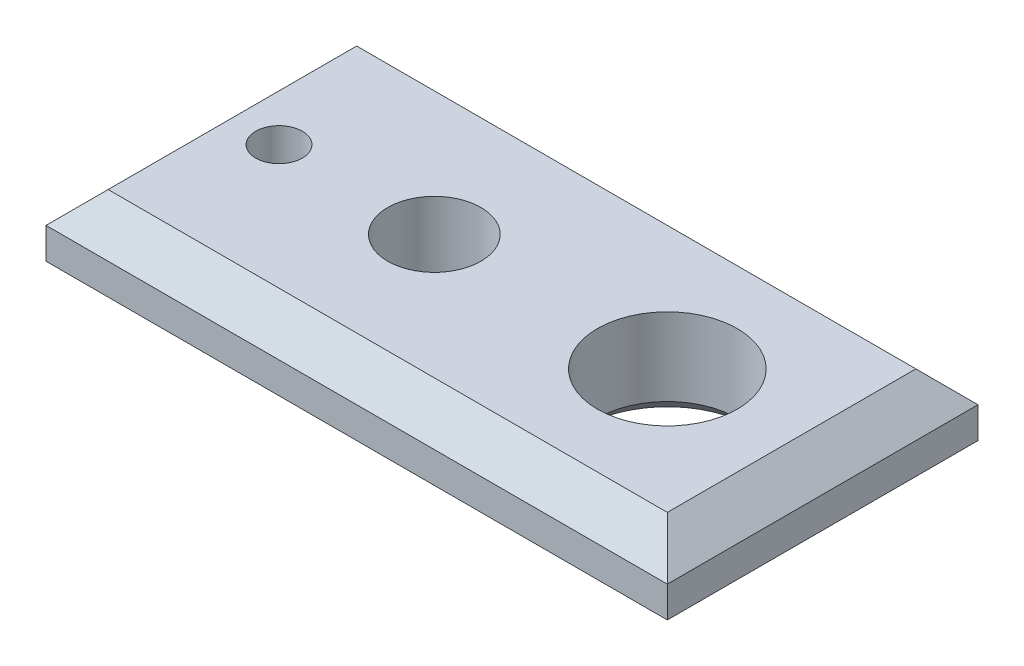
ISO-10303-21;
HEADER;
FILE_DESCRIPTION(('STEP AP214'),'2;1');
FILE_NAME('part.step','',(''),(''),'','','');
FILE_SCHEMA(('AUTOMOTIVE_DESIGN { 1 0 10303 214 1 1 1 1 }'));
ENDSEC;
DATA;
#1=APPLICATION_CONTEXT('core data for automotive mechanical design processes');
#2=APPLICATION_PROTOCOL_DEFINITION('international standard','automotive_design',2000,#1);
#3=PRODUCT_CONTEXT('',#1,'mechanical');
#4=PRODUCT('Part','Part','',(#3));
#5=PRODUCT_RELATED_PRODUCT_CATEGORY('part','',(#4));
#6=PRODUCT_DEFINITION_FORMATION('','',#4);
#7=PRODUCT_DEFINITION_CONTEXT('part definition',#1,'design');
#8=PRODUCT_DEFINITION('design','',#6,#7);
#9=PRODUCT_DEFINITION_SHAPE('','',#8);
#10=(LENGTH_UNIT() NAMED_UNIT(*) SI_UNIT(.MILLI.,.METRE.));
#11=(NAMED_UNIT(*) PLANE_ANGLE_UNIT() SI_UNIT($,.RADIAN.));
#12=(NAMED_UNIT(*) SI_UNIT($,.STERADIAN.) SOLID_ANGLE_UNIT());
#13=UNCERTAINTY_MEASURE_WITH_UNIT(LENGTH_MEASURE(1.E-05),#10,'distance_accuracy_value','');
#14=(GEOMETRIC_REPRESENTATION_CONTEXT(3) GLOBAL_UNCERTAINTY_ASSIGNED_CONTEXT((#13)) GLOBAL_UNIT_ASSIGNED_CONTEXT((#10,
#11,#12)) REPRESENTATION_CONTEXT('',''));
#15=CARTESIAN_POINT('',(0.,0.,0.));
#16=DIRECTION('',(0.,0.,1.));
#17=DIRECTION('',(1.,0.,0.));
#18=AXIS2_PLACEMENT_3D('',#15,#16,#17);
#19=CARTESIAN_POINT('',(100.,10.,-50.));
#20=DIRECTION('',(-1.,0.,0.));
#21=DIRECTION('',(0.,0.,1.));
#22=AXIS2_PLACEMENT_3D('',#19,#20,#21);
#23=PLANE('',#22);
#24=DIRECTION('',(0.,0.,1.));
#25=VECTOR('',#24,1.);
#26=CARTESIAN_POINT('',(100.,0.,-50.));
#27=LINE('',#26,#25);
#28=CARTESIAN_POINT('',(100.,0.,50.));
#29=VERTEX_POINT('',#28);
#30=CARTESIAN_POINT('',(100.,0.,-50.));
#31=VERTEX_POINT('',#30);
#32=EDGE_CURVE('E347',#29,#31,#27,.F.);
#33=ORIENTED_EDGE('',*,*,#32,.T.);
#34=DIRECTION('',(0.,-1.,0.));
#35=VECTOR('',#34,1.);
#36=CARTESIAN_POINT('',(100.,10.,-50.));
#37=LINE('',#36,#35);
#38=CARTESIAN_POINT('',(100.,9.99999999999999,-50.));
#39=VERTEX_POINT('',#38);
#40=EDGE_CURVE('E414',#39,#31,#37,.T.);
#41=ORIENTED_EDGE('',*,*,#40,.F.);
#42=DIRECTION('',(0.,0.,1.));
#43=VECTOR('',#42,1.);
#44=CARTESIAN_POINT('',(100.,10.,0.));
#45=LINE('',#44,#43);
#46=CARTESIAN_POINT('',(100.,10.,50.));
#47=VERTEX_POINT('',#46);
#48=EDGE_CURVE('E600',#47,#39,#45,.F.);
#49=ORIENTED_EDGE('',*,*,#48,.F.);
#50=DIRECTION('',(0.,-1.,0.));
#51=VECTOR('',#50,1.);
#52=CARTESIAN_POINT('',(100.,10.,50.));
#53=LINE('',#52,#51);
#54=EDGE_CURVE('E592',#47,#29,#53,.T.);
#55=ORIENTED_EDGE('',*,*,#54,.T.);
#56=EDGE_LOOP('',(#33,#41,#49,#55));
#57=FACE_BOUND('',#56,.T.);
#58=ADVANCED_FACE('F59',(#57),#23,.F.);
#59=CARTESIAN_POINT('',(-100.,10.,-50.));
#60=DIRECTION('',(0.,0.,1.));
#61=DIRECTION('',(1.,0.,0.));
#62=AXIS2_PLACEMENT_3D('',#59,#60,#61);
#63=PLANE('',#62);
#64=DIRECTION('',(1.,0.,0.));
#65=VECTOR('',#64,1.);
#66=CARTESIAN_POINT('',(-100.,0.,-50.));
#67=LINE('',#66,#65);
#68=CARTESIAN_POINT('',(-100.,0.,-50.));
#69=VERTEX_POINT('',#68);
#70=EDGE_CURVE('E282',#31,#69,#67,.F.);
#71=ORIENTED_EDGE('',*,*,#70,.T.);
#72=DIRECTION('',(0.,-1.,0.));
#73=VECTOR('',#72,1.);
#74=CARTESIAN_POINT('',(-100.,10.,-50.));
#75=LINE('',#74,#73);
#76=CARTESIAN_POINT('',(-100.,10.,-50.));
#77=VERTEX_POINT('',#76);
#78=EDGE_CURVE('E588',#77,#69,#75,.T.);
#79=ORIENTED_EDGE('',*,*,#78,.F.);
#80=DIRECTION('',(1.,0.,0.));
#81=VECTOR('',#80,1.);
#82=CARTESIAN_POINT('',(0.,10.,-50.));
#83=LINE('',#82,#81);
#84=EDGE_CURVE('E585',#39,#77,#83,.F.);
#85=ORIENTED_EDGE('',*,*,#84,.F.);
#86=ORIENTED_EDGE('',*,*,#40,.T.);
#87=EDGE_LOOP('',(#71,#79,#85,#86));
#88=FACE_BOUND('',#87,.T.);
#89=ADVANCED_FACE('F373',(#88),#63,.F.);
#90=CARTESIAN_POINT('',(-100.,10.,-50.));
#91=DIRECTION('',(1.,0.,0.));
#92=DIRECTION('',(0.,0.,-1.));
#93=AXIS2_PLACEMENT_3D('',#90,#91,#92);
#94=PLANE('',#93);
#95=DIRECTION('',(0.,0.,-1.));
#96=VECTOR('',#95,1.);
#97=CARTESIAN_POINT('',(-100.,0.,-50.));
#98=LINE('',#97,#96);
#99=CARTESIAN_POINT('',(-100.,0.,50.));
#100=VERTEX_POINT('',#99);
#101=EDGE_CURVE('E595',#69,#100,#98,.F.);
#102=ORIENTED_EDGE('',*,*,#101,.T.);
#103=DIRECTION('',(0.,-1.,0.));
#104=VECTOR('',#103,1.);
#105=CARTESIAN_POINT('',(-100.,10.,50.));
#106=LINE('',#105,#104);
#107=CARTESIAN_POINT('',(-100.,9.99999999999999,50.));
#108=VERTEX_POINT('',#107);
#109=EDGE_CURVE('E77',#108,#100,#106,.T.);
#110=ORIENTED_EDGE('',*,*,#109,.F.);
#111=DIRECTION('',(0.,0.,1.));
#112=VECTOR('',#111,1.);
#113=CARTESIAN_POINT('',(-100.,10.,0.));
#114=LINE('',#113,#112);
#115=EDGE_CURVE('E158',#77,#108,#114,.T.);
#116=ORIENTED_EDGE('',*,*,#115,.F.);
#117=ORIENTED_EDGE('',*,*,#78,.T.);
#118=EDGE_LOOP('',(#102,#110,#116,#117));
#119=FACE_BOUND('',#118,.T.);
#120=ADVANCED_FACE('F369',(#119),#94,.F.);
#121=CARTESIAN_POINT('',(-100.,10.,50.));
#122=DIRECTION('',(0.,0.,-1.));
#123=DIRECTION('',(-1.,0.,0.));
#124=AXIS2_PLACEMENT_3D('',#121,#122,#123);
#125=PLANE('',#124);
#126=DIRECTION('',(-1.,0.,0.));
#127=VECTOR('',#126,1.);
#128=CARTESIAN_POINT('',(-100.,0.,50.));
#129=LINE('',#128,#127);
#130=EDGE_CURVE('E597',#100,#29,#129,.F.);
#131=ORIENTED_EDGE('',*,*,#130,.T.);
#132=ORIENTED_EDGE('',*,*,#54,.F.);
#133=DIRECTION('',(1.,0.,0.));
#134=VECTOR('',#133,1.);
#135=CARTESIAN_POINT('',(0.,10.,50.));
#136=LINE('',#135,#134);
#137=EDGE_CURVE('E605',#108,#47,#136,.T.);
#138=ORIENTED_EDGE('',*,*,#137,.F.);
#139=ORIENTED_EDGE('',*,*,#109,.T.);
#140=EDGE_LOOP('',(#131,#132,#138,#139));
#141=FACE_BOUND('',#140,.T.);
#142=ADVANCED_FACE('F294',(#141),#125,.F.);
#143=CARTESIAN_POINT('',(0.,-10.,0.));
#144=DIRECTION('',(0.,1.,0.));
#145=DIRECTION('',(0.,0.,1.));
#146=AXIS2_PLACEMENT_3D('',#143,#144,#145);
#147=PLANE('',#146);
#148=CARTESIAN_POINT('',(50.,-10.,0.));
#149=DIRECTION('',(0.,1.,0.));
#150=DIRECTION('',(0.,0.,1.));
#151=AXIS2_PLACEMENT_3D('',#148,#149,#150);
#152=CIRCLE('',#151,27.5);
#153=CARTESIAN_POINT('',(50.,-10.,27.5));
#154=VERTEX_POINT('',#153);
#155=EDGE_CURVE('E405',#154,#154,#152,.T.);
#156=ORIENTED_EDGE('',*,*,#155,.T.);
#157=EDGE_LOOP('',(#156));
#158=FACE_BOUND('',#157,.T.);
#159=CARTESIAN_POINT('',(-25.,-10.,0.));
#160=DIRECTION('',(0.,1.,0.));
#161=DIRECTION('',(0.,0.,1.));
#162=AXIS2_PLACEMENT_3D('',#159,#160,#161);
#163=CIRCLE('',#162,20.);
#164=CARTESIAN_POINT('',(-25.,-10.,20.));
#165=VERTEX_POINT('',#164);
#166=EDGE_CURVE('E402',#165,#165,#163,.T.);
#167=ORIENTED_EDGE('',*,*,#166,.T.);
#168=EDGE_LOOP('',(#167));
#169=FACE_BOUND('',#168,.T.);
#170=CARTESIAN_POINT('',(-75.,-10.,0.));
#171=DIRECTION('',(0.,1.,0.));
#172=DIRECTION('',(0.,0.,1.));
#173=AXIS2_PLACEMENT_3D('',#170,#171,#172);
#174=CIRCLE('',#173,12.5);
#175=CARTESIAN_POINT('',(-75.,-10.,12.5));
#176=VERTEX_POINT('',#175);
#177=EDGE_CURVE('E406',#176,#176,#174,.T.);
#178=ORIENTED_EDGE('',*,*,#177,.T.);
#179=EDGE_LOOP('',(#178));
#180=FACE_BOUND('',#179,.T.);
#181=DIRECTION('',(0.,0.,-1.));
#182=VECTOR('',#181,1.);
#183=CARTESIAN_POINT('',(90.,-10.,-40.));
#184=LINE('',#183,#182);
#185=CARTESIAN_POINT('',(90.,-10.,40.));
#186=VERTEX_POINT('',#185);
#187=CARTESIAN_POINT('',(90.,-10.,-40.));
#188=VERTEX_POINT('',#187);
#189=EDGE_CURVE('E227',#186,#188,#184,.T.);
#190=ORIENTED_EDGE('',*,*,#189,.F.);
#191=DIRECTION('',(1.,0.,0.));
#192=VECTOR('',#191,1.);
#193=CARTESIAN_POINT('',(-90.,-10.,40.));
#194=LINE('',#193,#192);
#195=CARTESIAN_POINT('',(-90.,-10.,40.));
#196=VERTEX_POINT('',#195);
#197=EDGE_CURVE('E232',#196,#186,#194,.T.);
#198=ORIENTED_EDGE('',*,*,#197,.F.);
#199=DIRECTION('',(0.,0.,1.));
#200=VECTOR('',#199,1.);
#201=CARTESIAN_POINT('',(-90.,-10.,-40.));
#202=LINE('',#201,#200);
#203=CARTESIAN_POINT('',(-90.,-10.,-40.));
#204=VERTEX_POINT('',#203);
#205=EDGE_CURVE('E241',#204,#196,#202,.T.);
#206=ORIENTED_EDGE('',*,*,#205,.F.);
#207=DIRECTION('',(-1.,0.,0.));
#208=VECTOR('',#207,1.);
#209=CARTESIAN_POINT('',(-90.,-10.,-40.));
#210=LINE('',#209,#208);
#211=EDGE_CURVE('E250',#188,#204,#210,.T.);
#212=ORIENTED_EDGE('',*,*,#211,.F.);
#213=EDGE_LOOP('',(#190,#198,#206,#212));
#214=FACE_BOUND('',#213,.T.);
#215=ADVANCED_FACE('F284',(#158,#169,#180,#214),#147,.F.);
#216=CARTESIAN_POINT('',(0.,-25.,25.));
#217=DIRECTION('',(0.,-0.707106781186547,0.707106781186548));
#218=DIRECTION('',(0.,-0.707106781186548,-0.707106781186547));
#219=AXIS2_PLACEMENT_3D('',#216,#217,#218);
#220=PLANE('',#219);
#221=DIRECTION('',(0.577350269189627,0.577350269189625,0.577350269189625));
#222=VECTOR('',#221,1.);
#223=CARTESIAN_POINT('',(90.,-10.,40.));
#224=LINE('',#223,#222);
#225=EDGE_CURVE('E255',#186,#29,#224,.T.);
#226=ORIENTED_EDGE('',*,*,#225,.T.);
#227=ORIENTED_EDGE('',*,*,#130,.F.);
#228=DIRECTION('',(-0.577350269189625,0.577350269189627,0.577350269189626));
#229=VECTOR('',#228,1.);
#230=CARTESIAN_POINT('',(-90.,-10.,40.));
#231=LINE('',#230,#229);
#232=EDGE_CURVE('E319',#196,#100,#231,.T.);
#233=ORIENTED_EDGE('',*,*,#232,.F.);
#234=ORIENTED_EDGE('',*,*,#197,.T.);
#235=EDGE_LOOP('',(#226,#227,#233,#234));
#236=FACE_BOUND('',#235,.T.);
#237=ADVANCED_FACE('F293',(#236),#220,.T.);
#238=CARTESIAN_POINT('',(-50.0000000000001,-50.,0.));
#239=DIRECTION('',(-0.707106781186548,-0.707106781186547,0.));
#240=DIRECTION('',(0.707106781186547,-0.707106781186548,0.));
#241=AXIS2_PLACEMENT_3D('',#238,#239,#240);
#242=PLANE('',#241);
#243=ORIENTED_EDGE('',*,*,#232,.T.);
#244=ORIENTED_EDGE('',*,*,#101,.F.);
#245=DIRECTION('',(-0.577350269189626,0.577350269189626,-0.577350269189625));
#246=VECTOR('',#245,1.);
#247=CARTESIAN_POINT('',(-90.,-10.,-40.));
#248=LINE('',#247,#246);
#249=EDGE_CURVE('E329',#204,#69,#248,.T.);
#250=ORIENTED_EDGE('',*,*,#249,.F.);
#251=ORIENTED_EDGE('',*,*,#205,.T.);
#252=EDGE_LOOP('',(#243,#244,#250,#251));
#253=FACE_BOUND('',#252,.T.);
#254=ADVANCED_FACE('F302',(#253),#242,.T.);
#255=CARTESIAN_POINT('',(49.9999999999999,-50.,0.));
#256=DIRECTION('',(0.707106781186547,-0.707106781186548,0.));
#257=DIRECTION('',(0.707106781186548,0.707106781186547,0.));
#258=AXIS2_PLACEMENT_3D('',#255,#256,#257);
#259=PLANE('',#258);
#260=DIRECTION('',(0.577350269189626,0.577350269189626,-0.577350269189625));
#261=VECTOR('',#260,1.);
#262=CARTESIAN_POINT('',(90.,-10.,-40.));
#263=LINE('',#262,#261);
#264=EDGE_CURVE('E324',#188,#31,#263,.T.);
#265=ORIENTED_EDGE('',*,*,#264,.T.);
#266=ORIENTED_EDGE('',*,*,#32,.F.);
#267=ORIENTED_EDGE('',*,*,#225,.F.);
#268=ORIENTED_EDGE('',*,*,#189,.T.);
#269=EDGE_LOOP('',(#265,#266,#267,#268));
#270=FACE_BOUND('',#269,.T.);
#271=ADVANCED_FACE('F364',(#270),#259,.T.);
#272=CARTESIAN_POINT('',(0.,-25.,-25.));
#273=DIRECTION('',(0.,-0.707106781186547,-0.707106781186548));
#274=DIRECTION('',(0.,0.707106781186548,-0.707106781186547));
#275=AXIS2_PLACEMENT_3D('',#272,#273,#274);
#276=PLANE('',#275);
#277=ORIENTED_EDGE('',*,*,#249,.T.);
#278=ORIENTED_EDGE('',*,*,#70,.F.);
#279=ORIENTED_EDGE('',*,*,#264,.F.);
#280=ORIENTED_EDGE('',*,*,#211,.T.);
#281=EDGE_LOOP('',(#277,#278,#279,#280));
#282=FACE_BOUND('',#281,.T.);
#283=ADVANCED_FACE('F355',(#282),#276,.T.);
#284=CARTESIAN_POINT('',(0.,20.,0.));
#285=DIRECTION('',(0.,1.,0.));
#286=DIRECTION('',(0.,0.,1.));
#287=AXIS2_PLACEMENT_3D('',#284,#285,#286);
#288=PLANE('',#287);
#289=CARTESIAN_POINT('',(-75.,20.,0.));
#290=DIRECTION('',(0.,1.,0.));
#291=DIRECTION('',(0.,0.,1.));
#292=AXIS2_PLACEMENT_3D('',#289,#290,#291);
#293=CIRCLE('',#292,7.50000000000001);
#294=CARTESIAN_POINT('',(-75.,20.,7.50000000000001));
#295=VERTEX_POINT('',#294);
#296=EDGE_CURVE('E432',#295,#295,#293,.T.);
#297=ORIENTED_EDGE('',*,*,#296,.F.);
#298=EDGE_LOOP('',(#297));
#299=FACE_BOUND('',#298,.T.);
#300=CARTESIAN_POINT('',(-25.,20.,0.));
#301=DIRECTION('',(0.,1.,0.));
#302=DIRECTION('',(0.,0.,1.));
#303=AXIS2_PLACEMENT_3D('',#300,#301,#302);
#304=CIRCLE('',#303,15.);
#305=CARTESIAN_POINT('',(-25.,20.,15.));
#306=VERTEX_POINT('',#305);
#307=EDGE_CURVE('E429',#306,#306,#304,.T.);
#308=ORIENTED_EDGE('',*,*,#307,.F.);
#309=EDGE_LOOP('',(#308));
#310=FACE_BOUND('',#309,.T.);
#311=CARTESIAN_POINT('',(50.,20.,0.));
#312=DIRECTION('',(0.,1.,0.));
#313=DIRECTION('',(0.,0.,1.));
#314=AXIS2_PLACEMENT_3D('',#311,#312,#313);
#315=CIRCLE('',#314,22.5);
#316=CARTESIAN_POINT('',(50.,20.,22.5));
#317=VERTEX_POINT('',#316);
#318=EDGE_CURVE('E433',#317,#317,#315,.T.);
#319=ORIENTED_EDGE('',*,*,#318,.F.);
#320=EDGE_LOOP('',(#319));
#321=FACE_BOUND('',#320,.T.);
#322=DIRECTION('',(0.,0.,-1.));
#323=VECTOR('',#322,1.);
#324=CARTESIAN_POINT('',(90.,20.,-40.));
#325=LINE('',#324,#323);
#326=CARTESIAN_POINT('',(90.,20.,40.));
#327=VERTEX_POINT('',#326);
#328=CARTESIAN_POINT('',(90.,20.,-40.));
#329=VERTEX_POINT('',#328);
#330=EDGE_CURVE('E152',#327,#329,#325,.T.);
#331=ORIENTED_EDGE('',*,*,#330,.T.);
#332=DIRECTION('',(-1.,0.,0.));
#333=VECTOR('',#332,1.);
#334=CARTESIAN_POINT('',(-90.,20.,-40.));
#335=LINE('',#334,#333);
#336=CARTESIAN_POINT('',(-90.,20.,-40.));
#337=VERTEX_POINT('',#336);
#338=EDGE_CURVE('E131',#329,#337,#335,.T.);
#339=ORIENTED_EDGE('',*,*,#338,.T.);
#340=DIRECTION('',(0.,0.,1.));
#341=VECTOR('',#340,1.);
#342=CARTESIAN_POINT('',(-90.,20.,-40.));
#343=LINE('',#342,#341);
#344=CARTESIAN_POINT('',(-90.,20.,40.));
#345=VERTEX_POINT('',#344);
#346=EDGE_CURVE('E122',#337,#345,#343,.T.);
#347=ORIENTED_EDGE('',*,*,#346,.T.);
#348=DIRECTION('',(1.,0.,0.));
#349=VECTOR('',#348,1.);
#350=CARTESIAN_POINT('',(-90.,20.,40.));
#351=LINE('',#350,#349);
#352=EDGE_CURVE('E127',#345,#327,#351,.T.);
#353=ORIENTED_EDGE('',*,*,#352,.T.);
#354=EDGE_LOOP('',(#331,#339,#347,#353));
#355=FACE_BOUND('',#354,.T.);
#356=ADVANCED_FACE('F126',(#299,#310,#321,#355),#288,.T.);
#357=CARTESIAN_POINT('',(-55.0000000000001,55.,0.));
#358=DIRECTION('',(-0.707106781186548,0.707106781186547,0.));
#359=DIRECTION('',(-0.707106781186547,-0.707106781186548,0.));
#360=AXIS2_PLACEMENT_3D('',#357,#358,#359);
#361=PLANE('',#360);
#362=DIRECTION('',(-0.577350269189626,-0.577350269189626,-0.577350269189625));
#363=VECTOR('',#362,1.);
#364=CARTESIAN_POINT('',(-90.,20.,-40.));
#365=LINE('',#364,#363);
#366=EDGE_CURVE('E161',#337,#77,#365,.T.);
#367=ORIENTED_EDGE('',*,*,#366,.T.);
#368=ORIENTED_EDGE('',*,*,#115,.T.);
#369=DIRECTION('',(-0.577350269189625,-0.577350269189627,0.577350269189626));
#370=VECTOR('',#369,1.);
#371=CARTESIAN_POINT('',(-90.,20.,40.));
#372=LINE('',#371,#370);
#373=EDGE_CURVE('E148',#345,#108,#372,.T.);
#374=ORIENTED_EDGE('',*,*,#373,.F.);
#375=ORIENTED_EDGE('',*,*,#346,.F.);
#376=EDGE_LOOP('',(#367,#368,#374,#375));
#377=FACE_BOUND('',#376,.T.);
#378=ADVANCED_FACE('F157',(#377),#361,.T.);
#379=CARTESIAN_POINT('',(0.,30.,30.));
#380=DIRECTION('',(0.,0.707106781186547,0.707106781186548));
#381=DIRECTION('',(0.,-0.707106781186548,0.707106781186547));
#382=AXIS2_PLACEMENT_3D('',#379,#380,#381);
#383=PLANE('',#382);
#384=ORIENTED_EDGE('',*,*,#373,.T.);
#385=ORIENTED_EDGE('',*,*,#137,.T.);
#386=DIRECTION('',(0.577350269189628,-0.577350269189625,0.577350269189625));
#387=VECTOR('',#386,1.);
#388=CARTESIAN_POINT('',(90.,20.,40.));
#389=LINE('',#388,#387);
#390=EDGE_CURVE('E150',#327,#47,#389,.T.);
#391=ORIENTED_EDGE('',*,*,#390,.F.);
#392=ORIENTED_EDGE('',*,*,#352,.F.);
#393=EDGE_LOOP('',(#384,#385,#391,#392));
#394=FACE_BOUND('',#393,.T.);
#395=ADVANCED_FACE('F146',(#394),#383,.T.);
#396=CARTESIAN_POINT('',(0.,30.,-30.));
#397=DIRECTION('',(0.,0.707106781186547,-0.707106781186548));
#398=DIRECTION('',(0.,0.707106781186548,0.707106781186547));
#399=AXIS2_PLACEMENT_3D('',#396,#397,#398);
#400=PLANE('',#399);
#401=DIRECTION('',(0.577350269189627,-0.577350269189626,-0.577350269189625));
#402=VECTOR('',#401,1.);
#403=CARTESIAN_POINT('',(90.,20.,-40.));
#404=LINE('',#403,#402);
#405=EDGE_CURVE('E160',#329,#39,#404,.T.);
#406=ORIENTED_EDGE('',*,*,#405,.T.);
#407=ORIENTED_EDGE('',*,*,#84,.T.);
#408=ORIENTED_EDGE('',*,*,#366,.F.);
#409=ORIENTED_EDGE('',*,*,#338,.F.);
#410=EDGE_LOOP('',(#406,#407,#408,#409));
#411=FACE_BOUND('',#410,.T.);
#412=ADVANCED_FACE('F193',(#411),#400,.T.);
#413=CARTESIAN_POINT('',(54.9999999999999,55.,0.));
#414=DIRECTION('',(0.707106781186546,0.707106781186549,0.));
#415=DIRECTION('',(-0.707106781186549,0.707106781186546,0.));
#416=AXIS2_PLACEMENT_3D('',#413,#414,#415);
#417=PLANE('',#416);
#418=ORIENTED_EDGE('',*,*,#390,.T.);
#419=ORIENTED_EDGE('',*,*,#48,.T.);
#420=ORIENTED_EDGE('',*,*,#405,.F.);
#421=ORIENTED_EDGE('',*,*,#330,.F.);
#422=EDGE_LOOP('',(#418,#419,#420,#421));
#423=FACE_BOUND('',#422,.T.);
#424=ADVANCED_FACE('F197',(#423),#417,.T.);
#425=CARTESIAN_POINT('',(50.,-10.,0.));
#426=DIRECTION('',(0.,1.,0.));
#427=DIRECTION('',(0.,0.,1.));
#428=AXIS2_PLACEMENT_3D('',#425,#426,#427);
#429=CYLINDRICAL_SURFACE('',#428,22.5);
#430=CARTESIAN_POINT('',(50.,-5.,0.));
#431=DIRECTION('',(0.,1.,0.));
#432=DIRECTION('',(0.,0.,1.));
#433=AXIS2_PLACEMENT_3D('',#430,#431,#432);
#434=CIRCLE('',#433,22.5);
#435=CARTESIAN_POINT('',(50.,-5.,22.5));
#436=VERTEX_POINT('',#435);
#437=EDGE_CURVE('E411',#436,#436,#434,.F.);
#438=ORIENTED_EDGE('',*,*,#437,.T.);
#439=EDGE_LOOP('',(#438));
#440=FACE_BOUND('',#439,.T.);
#441=ORIENTED_EDGE('',*,*,#318,.T.);
#442=EDGE_LOOP('',(#441));
#443=FACE_BOUND('',#442,.T.);
#444=ADVANCED_FACE('F425',(#440,#443),#429,.F.);
#445=CARTESIAN_POINT('',(-25.,-10.,0.));
#446=DIRECTION('',(0.,1.,0.));
#447=DIRECTION('',(0.,0.,1.));
#448=AXIS2_PLACEMENT_3D('',#445,#446,#447);
#449=CYLINDRICAL_SURFACE('',#448,15.);
#450=CARTESIAN_POINT('',(-25.,-5.00000000000001,0.));
#451=DIRECTION('',(0.,1.,0.));
#452=DIRECTION('',(0.,0.,1.));
#453=AXIS2_PLACEMENT_3D('',#450,#451,#452);
#454=CIRCLE('',#453,15.);
#455=CARTESIAN_POINT('',(-25.,-5.00000000000001,15.));
#456=VERTEX_POINT('',#455);
#457=EDGE_CURVE('E70',#456,#456,#454,.F.);
#458=ORIENTED_EDGE('',*,*,#457,.T.);
#459=EDGE_LOOP('',(#458));
#460=FACE_BOUND('',#459,.T.);
#461=ORIENTED_EDGE('',*,*,#307,.T.);
#462=EDGE_LOOP('',(#461));
#463=FACE_BOUND('',#462,.T.);
#464=ADVANCED_FACE('F422',(#460,#463),#449,.F.);
#465=CARTESIAN_POINT('',(-75.,-10.,0.));
#466=DIRECTION('',(0.,1.,0.));
#467=DIRECTION('',(0.,0.,1.));
#468=AXIS2_PLACEMENT_3D('',#465,#466,#467);
#469=CYLINDRICAL_SURFACE('',#468,7.50000000000001);
#470=CARTESIAN_POINT('',(-75.,-4.99999999999997,0.));
#471=DIRECTION('',(0.,1.,0.));
#472=DIRECTION('',(0.,0.,1.));
#473=AXIS2_PLACEMENT_3D('',#470,#471,#472);
#474=CIRCLE('',#473,7.50000000000001);
#475=CARTESIAN_POINT('',(-75.,-4.99999999999997,7.50000000000001));
#476=VERTEX_POINT('',#475);
#477=EDGE_CURVE('E12',#476,#476,#474,.F.);
#478=ORIENTED_EDGE('',*,*,#477,.T.);
#479=EDGE_LOOP('',(#478));
#480=FACE_BOUND('',#479,.T.);
#481=ORIENTED_EDGE('',*,*,#296,.T.);
#482=EDGE_LOOP('',(#481));
#483=FACE_BOUND('',#482,.T.);
#484=ADVANCED_FACE('F387',(#480,#483),#469,.F.);
#485=CARTESIAN_POINT('',(50.,-10.,0.));
#486=DIRECTION('',(0.,-1.,0.));
#487=DIRECTION('',(0.,0.,-1.));
#488=AXIS2_PLACEMENT_3D('',#485,#486,#487);
#489=CONICAL_SURFACE('',#488,27.5,0.785398163397448);
#490=ORIENTED_EDGE('',*,*,#437,.F.);
#491=EDGE_LOOP('',(#490));
#492=FACE_BOUND('',#491,.T.);
#493=ORIENTED_EDGE('',*,*,#155,.F.);
#494=EDGE_LOOP('',(#493));
#495=FACE_BOUND('',#494,.T.);
#496=ADVANCED_FACE('F381',(#492,#495),#489,.F.);
#497=CARTESIAN_POINT('',(-25.,-10.,0.));
#498=DIRECTION('',(0.,-1.,0.));
#499=DIRECTION('',(0.,0.,-1.));
#500=AXIS2_PLACEMENT_3D('',#497,#498,#499);
#501=CONICAL_SURFACE('',#500,20.,0.785398163397448);
#502=ORIENTED_EDGE('',*,*,#457,.F.);
#503=EDGE_LOOP('',(#502));
#504=FACE_BOUND('',#503,.T.);
#505=ORIENTED_EDGE('',*,*,#166,.F.);
#506=EDGE_LOOP('',(#505));
#507=FACE_BOUND('',#506,.T.);
#508=ADVANCED_FACE('F386',(#504,#507),#501,.F.);
#509=CARTESIAN_POINT('',(-75.,-10.,0.));
#510=DIRECTION('',(0.,-1.,0.));
#511=DIRECTION('',(0.,0.,-1.));
#512=AXIS2_PLACEMENT_3D('',#509,#510,#511);
#513=CONICAL_SURFACE('',#512,12.5,0.785398163397448);
#514=ORIENTED_EDGE('',*,*,#477,.F.);
#515=EDGE_LOOP('',(#514));
#516=FACE_BOUND('',#515,.T.);
#517=ORIENTED_EDGE('',*,*,#177,.F.);
#518=EDGE_LOOP('',(#517));
#519=FACE_BOUND('',#518,.T.);
#520=ADVANCED_FACE('F62',(#516,#519),#513,.F.);
#521=CLOSED_SHELL('',(#58,#89,#120,#142,#215,#237,#254,#271,#283,#356,#378,#395,#412,#424,#444,
#464,#484,#496,#508,#520));
#522=MANIFOLD_SOLID_BREP('B2',#521);
#523=ADVANCED_BREP_SHAPE_REPRESENTATION('',(#18,#522),#14);
#524=SHAPE_DEFINITION_REPRESENTATION(#9,#523);
ENDSEC;
END-ISO-10303-21;
